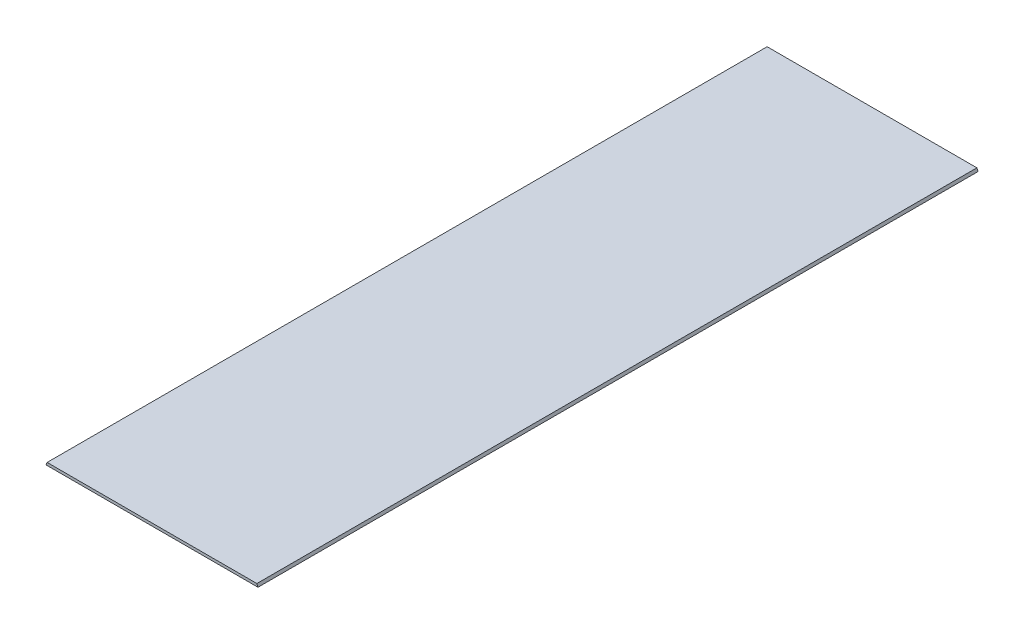
ISO-10303-21;
HEADER;
FILE_DESCRIPTION(('STEP AP214'),'2;1');
FILE_NAME('part.step','',(''),(''),'','','');
FILE_SCHEMA(('AUTOMOTIVE_DESIGN { 1 0 10303 214 1 1 1 1 }'));
ENDSEC;
DATA;
#1=APPLICATION_CONTEXT('core data for automotive mechanical design processes');
#2=APPLICATION_PROTOCOL_DEFINITION('international standard','automotive_design',2000,#1);
#3=PRODUCT_CONTEXT('',#1,'mechanical');
#4=PRODUCT('Part','Part','',(#3));
#5=PRODUCT_RELATED_PRODUCT_CATEGORY('part','',(#4));
#6=PRODUCT_DEFINITION_FORMATION('','',#4);
#7=PRODUCT_DEFINITION_CONTEXT('part definition',#1,'design');
#8=PRODUCT_DEFINITION('design','',#6,#7);
#9=PRODUCT_DEFINITION_SHAPE('','',#8);
#10=(LENGTH_UNIT() NAMED_UNIT(*) SI_UNIT(.MILLI.,.METRE.));
#11=(NAMED_UNIT(*) PLANE_ANGLE_UNIT() SI_UNIT($,.RADIAN.));
#12=(NAMED_UNIT(*) SI_UNIT($,.STERADIAN.) SOLID_ANGLE_UNIT());
#13=UNCERTAINTY_MEASURE_WITH_UNIT(LENGTH_MEASURE(1.E-05),#10,'distance_accuracy_value','');
#14=(GEOMETRIC_REPRESENTATION_CONTEXT(3) GLOBAL_UNCERTAINTY_ASSIGNED_CONTEXT((#13)) GLOBAL_UNIT_ASSIGNED_CONTEXT((#10,
#11,#12)) REPRESENTATION_CONTEXT('',''));
#15=CARTESIAN_POINT('',(0.,0.,0.));
#16=DIRECTION('',(0.,0.,1.));
#17=DIRECTION('',(1.,0.,0.));
#18=AXIS2_PLACEMENT_3D('',#15,#16,#17);
#19=CARTESIAN_POINT('',(185.090910554075,0.,628.65));
#20=DIRECTION('',(0.,1.,0.));
#21=DIRECTION('',(0.,0.,1.));
#22=AXIS2_PLACEMENT_3D('',#19,#20,#21);
#23=PLANE('',#22);
#24=DIRECTION('',(1.,0.,0.));
#25=VECTOR('',#24,1.);
#26=CARTESIAN_POINT('',(185.090910554075,0.,0.));
#27=LINE('',#26,#25);
#28=CARTESIAN_POINT('',(0.,0.,0.));
#29=VERTEX_POINT('',#28);
#30=CARTESIAN_POINT('',(185.090910554075,0.,0.));
#31=VERTEX_POINT('',#30);
#32=EDGE_CURVE('E96',#29,#31,#27,.T.);
#33=ORIENTED_EDGE('',*,*,#32,.T.);
#34=DIRECTION('',(0.,0.,-1.));
#35=VECTOR('',#34,1.);
#36=CARTESIAN_POINT('',(185.090910554075,0.,628.65));
#37=LINE('',#36,#35);
#38=CARTESIAN_POINT('',(185.090910554075,0.,628.65));
#39=VERTEX_POINT('',#38);
#40=EDGE_CURVE('E11',#39,#31,#37,.T.);
#41=ORIENTED_EDGE('',*,*,#40,.F.);
#42=DIRECTION('',(1.,0.,0.));
#43=VECTOR('',#42,1.);
#44=CARTESIAN_POINT('',(185.090910554075,0.,628.65));
#45=LINE('',#44,#43);
#46=CARTESIAN_POINT('',(0.,0.,628.65));
#47=VERTEX_POINT('',#46);
#48=EDGE_CURVE('E84',#47,#39,#45,.T.);
#49=ORIENTED_EDGE('',*,*,#48,.F.);
#50=DIRECTION('',(0.,0.,-1.));
#51=VECTOR('',#50,1.);
#52=CARTESIAN_POINT('',(0.,0.,628.65));
#53=LINE('',#52,#51);
#54=EDGE_CURVE('E92',#47,#29,#53,.T.);
#55=ORIENTED_EDGE('',*,*,#54,.T.);
#56=EDGE_LOOP('',(#33,#41,#49,#55));
#57=FACE_BOUND('',#56,.T.);
#58=ADVANCED_FACE('F33',(#57),#23,.F.);
#59=CARTESIAN_POINT('',(184.112455277038,2.36219999999998,628.65));
#60=DIRECTION('',(-0.923879532511287,-0.38268343236509,0.));
#61=DIRECTION('',(0.38268343236509,-0.923879532511287,0.));
#62=AXIS2_PLACEMENT_3D('',#59,#60,#61);
#63=PLANE('',#62);
#64=DIRECTION('',(-0.38268343236509,0.923879532511287,0.));
#65=VECTOR('',#64,1.);
#66=CARTESIAN_POINT('',(184.112455277038,2.36219999999998,0.));
#67=LINE('',#66,#65);
#68=CARTESIAN_POINT('',(184.112455277038,2.36219999999998,0.));
#69=VERTEX_POINT('',#68);
#70=EDGE_CURVE('E88',#31,#69,#67,.T.);
#71=ORIENTED_EDGE('',*,*,#70,.T.);
#72=DIRECTION('',(0.,0.,-1.));
#73=VECTOR('',#72,1.);
#74=CARTESIAN_POINT('',(184.112455277038,2.36219999999998,628.65));
#75=LINE('',#74,#73);
#76=CARTESIAN_POINT('',(184.112455277038,2.36219999999998,628.65));
#77=VERTEX_POINT('',#76);
#78=EDGE_CURVE('E41',#77,#69,#75,.T.);
#79=ORIENTED_EDGE('',*,*,#78,.F.);
#80=DIRECTION('',(-0.38268343236509,0.923879532511287,0.));
#81=VECTOR('',#80,1.);
#82=CARTESIAN_POINT('',(184.112455277038,2.36219999999998,628.65));
#83=LINE('',#82,#81);
#84=EDGE_CURVE('E79',#39,#77,#83,.T.);
#85=ORIENTED_EDGE('',*,*,#84,.F.);
#86=ORIENTED_EDGE('',*,*,#40,.T.);
#87=EDGE_LOOP('',(#71,#79,#85,#86));
#88=FACE_BOUND('',#87,.T.);
#89=ADVANCED_FACE('F87',(#88),#63,.F.);
#90=CARTESIAN_POINT('',(0.978455277037728,2.36219999999998,628.65));
#91=DIRECTION('',(0.,-1.,0.));
#92=DIRECTION('',(0.,0.,-1.));
#93=AXIS2_PLACEMENT_3D('',#90,#91,#92);
#94=PLANE('',#93);
#95=DIRECTION('',(-1.,0.,0.));
#96=VECTOR('',#95,1.);
#97=CARTESIAN_POINT('',(0.978455277037728,2.36219999999998,0.));
#98=LINE('',#97,#96);
#99=CARTESIAN_POINT('',(0.978455277037728,2.36219999999998,0.));
#100=VERTEX_POINT('',#99);
#101=EDGE_CURVE('E66',#69,#100,#98,.T.);
#102=ORIENTED_EDGE('',*,*,#101,.T.);
#103=DIRECTION('',(0.,0.,-1.));
#104=VECTOR('',#103,1.);
#105=CARTESIAN_POINT('',(0.978455277037728,2.36219999999998,628.65));
#106=LINE('',#105,#104);
#107=CARTESIAN_POINT('',(0.978455277037728,2.36219999999998,628.65));
#108=VERTEX_POINT('',#107);
#109=EDGE_CURVE('E89',#108,#100,#106,.T.);
#110=ORIENTED_EDGE('',*,*,#109,.F.);
#111=DIRECTION('',(-1.,0.,0.));
#112=VECTOR('',#111,1.);
#113=CARTESIAN_POINT('',(0.978455277037728,2.36219999999998,628.65));
#114=LINE('',#113,#112);
#115=EDGE_CURVE('E82',#77,#108,#114,.T.);
#116=ORIENTED_EDGE('',*,*,#115,.F.);
#117=ORIENTED_EDGE('',*,*,#78,.T.);
#118=EDGE_LOOP('',(#102,#110,#116,#117));
#119=FACE_BOUND('',#118,.T.);
#120=ADVANCED_FACE('F90',(#119),#94,.F.);
#121=CARTESIAN_POINT('',(0.,0.,628.65));
#122=DIRECTION('',(0.923879532511285,-0.382683432365094,0.));
#123=DIRECTION('',(0.382683432365094,0.923879532511285,0.));
#124=AXIS2_PLACEMENT_3D('',#121,#122,#123);
#125=PLANE('',#124);
#126=DIRECTION('',(-0.382683432365094,-0.923879532511285,0.));
#127=VECTOR('',#126,1.);
#128=CARTESIAN_POINT('',(0.,0.,0.));
#129=LINE('',#128,#127);
#130=EDGE_CURVE('E72',#100,#29,#129,.T.);
#131=ORIENTED_EDGE('',*,*,#130,.T.);
#132=ORIENTED_EDGE('',*,*,#54,.F.);
#133=DIRECTION('',(-0.382683432365094,-0.923879532511285,0.));
#134=VECTOR('',#133,1.);
#135=CARTESIAN_POINT('',(0.,0.,628.65));
#136=LINE('',#135,#134);
#137=EDGE_CURVE('E49',#108,#47,#136,.T.);
#138=ORIENTED_EDGE('',*,*,#137,.F.);
#139=ORIENTED_EDGE('',*,*,#109,.T.);
#140=EDGE_LOOP('',(#131,#132,#138,#139));
#141=FACE_BOUND('',#140,.T.);
#142=ADVANCED_FACE('F103',(#141),#125,.F.);
#143=CARTESIAN_POINT('',(0.,0.,628.65));
#144=DIRECTION('',(0.,0.,-1.));
#145=DIRECTION('',(-1.,0.,0.));
#146=AXIS2_PLACEMENT_3D('',#143,#144,#145);
#147=PLANE('',#146);
#148=ORIENTED_EDGE('',*,*,#48,.T.);
#149=ORIENTED_EDGE('',*,*,#84,.T.);
#150=ORIENTED_EDGE('',*,*,#115,.T.);
#151=ORIENTED_EDGE('',*,*,#137,.T.);
#152=EDGE_LOOP('',(#148,#149,#150,#151));
#153=FACE_BOUND('',#152,.T.);
#154=ADVANCED_FACE('F80',(#153),#147,.F.);
#155=CARTESIAN_POINT('',(0.,0.,0.));
#156=DIRECTION('',(0.,0.,-1.));
#157=DIRECTION('',(-1.,0.,0.));
#158=AXIS2_PLACEMENT_3D('',#155,#156,#157);
#159=PLANE('',#158);
#160=ORIENTED_EDGE('',*,*,#32,.F.);
#161=ORIENTED_EDGE('',*,*,#130,.F.);
#162=ORIENTED_EDGE('',*,*,#101,.F.);
#163=ORIENTED_EDGE('',*,*,#70,.F.);
#164=EDGE_LOOP('',(#160,#161,#162,#163));
#165=FACE_BOUND('',#164,.T.);
#166=ADVANCED_FACE('F106',(#165),#159,.T.);
#167=CLOSED_SHELL('',(#58,#89,#120,#142,#154,#166));
#168=MANIFOLD_SOLID_BREP('B2',#167);
#169=ADVANCED_BREP_SHAPE_REPRESENTATION('',(#18,#168),#14);
#170=SHAPE_DEFINITION_REPRESENTATION(#9,#169);
ENDSEC;
END-ISO-10303-21;
